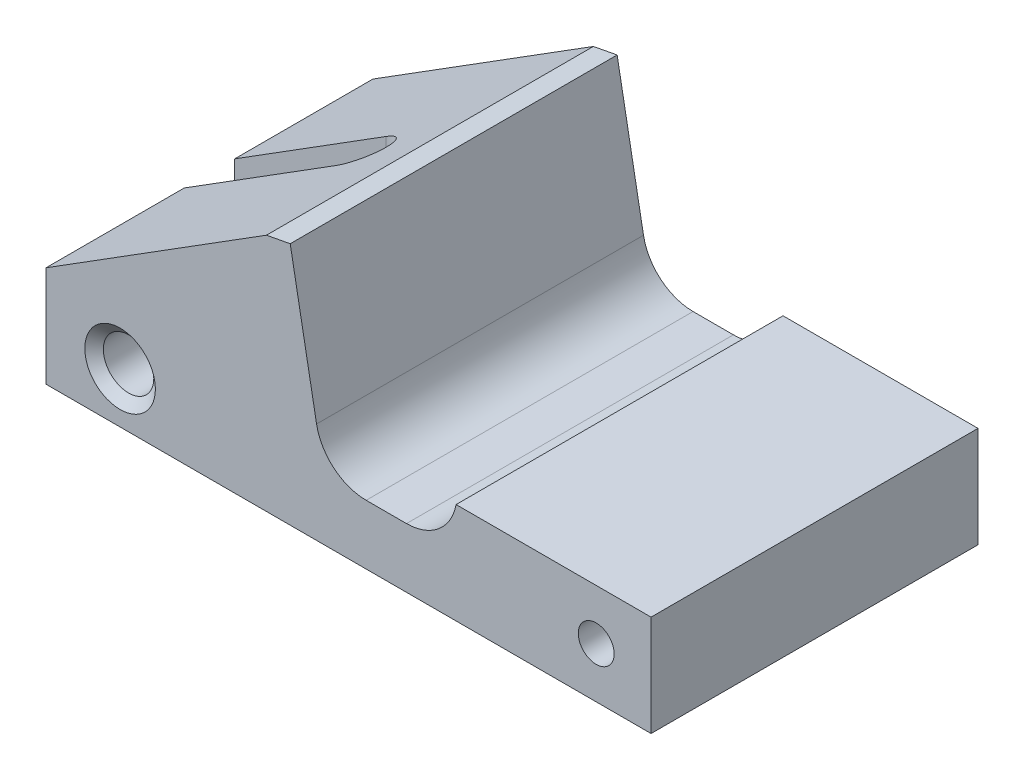
ISO-10303-21;
HEADER;
FILE_DESCRIPTION(('STEP AP214'),'2;1');
FILE_NAME('part.step','',(''),(''),'','','');
FILE_SCHEMA(('AUTOMOTIVE_DESIGN { 1 0 10303 214 1 1 1 1 }'));
ENDSEC;
DATA;
#1=APPLICATION_CONTEXT('core data for automotive mechanical design processes');
#2=APPLICATION_PROTOCOL_DEFINITION('international standard','automotive_design',2000,#1);
#3=PRODUCT_CONTEXT('',#1,'mechanical');
#4=PRODUCT('Part','Part','',(#3));
#5=PRODUCT_RELATED_PRODUCT_CATEGORY('part','',(#4));
#6=PRODUCT_DEFINITION_FORMATION('','',#4);
#7=PRODUCT_DEFINITION_CONTEXT('part definition',#1,'design');
#8=PRODUCT_DEFINITION('design','',#6,#7);
#9=PRODUCT_DEFINITION_SHAPE('','',#8);
#10=(LENGTH_UNIT() NAMED_UNIT(*) SI_UNIT(.MILLI.,.METRE.));
#11=(NAMED_UNIT(*) PLANE_ANGLE_UNIT() SI_UNIT($,.RADIAN.));
#12=(NAMED_UNIT(*) SI_UNIT($,.STERADIAN.) SOLID_ANGLE_UNIT());
#13=UNCERTAINTY_MEASURE_WITH_UNIT(LENGTH_MEASURE(1.E-05),#10,'distance_accuracy_value','');
#14=(GEOMETRIC_REPRESENTATION_CONTEXT(3) GLOBAL_UNCERTAINTY_ASSIGNED_CONTEXT((#13)) GLOBAL_UNIT_ASSIGNED_CONTEXT((#10,
#11,#12)) REPRESENTATION_CONTEXT('',''));
#15=CARTESIAN_POINT('',(0.,0.,0.));
#16=DIRECTION('',(0.,0.,1.));
#17=DIRECTION('',(1.,0.,0.));
#18=AXIS2_PLACEMENT_3D('',#15,#16,#17);
#19=CARTESIAN_POINT('',(0.,-74.8903123925255,64.202459724012));
#20=DIRECTION('',(0.,1.,0.));
#21=DIRECTION('',(0.,0.,1.));
#22=AXIS2_PLACEMENT_3D('',#19,#20,#21);
#23=PLANE('',#22);
#24=DIRECTION('',(1.,0.,0.));
#25=VECTOR('',#24,1.);
#26=CARTESIAN_POINT('',(-76.5670343709603,-74.8903123925255,13.15057164816));
#27=LINE('',#26,#25);
#28=CARTESIAN_POINT('',(-76.5670343709603,-74.8903123925255,13.15057164816));
#29=VERTEX_POINT('',#28);
#30=CARTESIAN_POINT('',(-67.0420343709603,-74.8903123925255,13.15057164816));
#31=VERTEX_POINT('',#30);
#32=EDGE_CURVE('E195',#29,#31,#27,.T.);
#33=ORIENTED_EDGE('',*,*,#32,.T.);
#34=CARTESIAN_POINT('',(-67.0420343709603,-74.8903123925255,11.56307164816));
#35=DIRECTION('',(0.,1.,0.));
#36=DIRECTION('',(0.,0.,1.));
#37=AXIS2_PLACEMENT_3D('',#34,#35,#36);
#38=CIRCLE('',#37,1.5875);
#39=CARTESIAN_POINT('',(-67.0420343709603,-74.8903123925255,9.97557164816));
#40=VERTEX_POINT('',#39);
#41=EDGE_CURVE('E192',#31,#40,#38,.T.);
#42=ORIENTED_EDGE('',*,*,#41,.T.);
#43=DIRECTION('',(-1.,0.,0.));
#44=VECTOR('',#43,1.);
#45=CARTESIAN_POINT('',(-76.5670343709603,-74.8903123925255,9.97557164816));
#46=LINE('',#45,#44);
#47=CARTESIAN_POINT('',(-76.5670343709603,-74.8903123925255,9.97557164816));
#48=VERTEX_POINT('',#47);
#49=EDGE_CURVE('E189',#40,#48,#46,.T.);
#50=ORIENTED_EDGE('',*,*,#49,.T.);
#51=DIRECTION('',(0.,0.,-1.));
#52=VECTOR('',#51,1.);
#53=CARTESIAN_POINT('',(-76.5670343709603,-74.8903123925255,64.202459724012));
#54=LINE('',#53,#52);
#55=CARTESIAN_POINT('',(-76.5670343709603,-74.8903123925255,1.27));
#56=VERTEX_POINT('',#55);
#57=EDGE_CURVE('E145',#48,#56,#54,.T.);
#58=ORIENTED_EDGE('',*,*,#57,.T.);
#59=DIRECTION('',(1.,0.,0.));
#60=VECTOR('',#59,1.);
#61=CARTESIAN_POINT('',(0.,-74.8903123925255,1.27));
#62=LINE('',#61,#60);
#63=CARTESIAN_POINT('',(-38.4670343709603,-74.8903123925255,1.27));
#64=VERTEX_POINT('',#63);
#65=EDGE_CURVE('E139',#56,#64,#62,.T.);
#66=ORIENTED_EDGE('',*,*,#65,.T.);
#67=DIRECTION('',(0.,0.,-1.));
#68=VECTOR('',#67,1.);
#69=CARTESIAN_POINT('',(-38.4670343709603,-74.8903123925255,64.202459724012));
#70=LINE('',#69,#68);
#71=CARTESIAN_POINT('',(-38.4670343709603,-74.8903123925255,21.85614329632));
#72=VERTEX_POINT('',#71);
#73=EDGE_CURVE('E142',#72,#64,#70,.T.);
#74=ORIENTED_EDGE('',*,*,#73,.F.);
#75=DIRECTION('',(-1.,0.,0.));
#76=VECTOR('',#75,1.);
#77=CARTESIAN_POINT('',(0.,-74.8903123925255,21.8561432963201));
#78=LINE('',#77,#76);
#79=CARTESIAN_POINT('',(-76.5670343709603,-74.8903123925255,21.85614329632));
#80=VERTEX_POINT('',#79);
#81=EDGE_CURVE('E82',#72,#80,#78,.T.);
#82=ORIENTED_EDGE('',*,*,#81,.T.);
#83=EDGE_CURVE('E146',#80,#29,#54,.T.);
#84=ORIENTED_EDGE('',*,*,#83,.T.);
#85=EDGE_LOOP('',(#33,#42,#50,#58,#66,#74,#82,#84));
#86=FACE_BOUND('',#85,.T.);
#87=ADVANCED_FACE('F39',(#86),#23,.F.);
#88=CARTESIAN_POINT('',(-76.5670343709603,0.,64.202459724012));
#89=DIRECTION('',(1.,0.,0.));
#90=DIRECTION('',(0.,0.,-1.));
#91=AXIS2_PLACEMENT_3D('',#88,#89,#90);
#92=PLANE('',#91);
#93=DIRECTION('',(0.,-1.,0.));
#94=VECTOR('',#93,1.);
#95=CARTESIAN_POINT('',(-76.5670343709603,-59.5392938182459,13.15057164816));
#96=LINE('',#95,#94);
#97=CARTESIAN_POINT('',(-76.5670343709604,-68.5403123925256,13.15057164816));
#98=VERTEX_POINT('',#97);
#99=EDGE_CURVE('E127',#98,#29,#96,.T.);
#100=ORIENTED_EDGE('',*,*,#99,.T.);
#101=ORIENTED_EDGE('',*,*,#83,.F.);
#102=DIRECTION('',(0.,1.,0.));
#103=VECTOR('',#102,1.);
#104=CARTESIAN_POINT('',(-76.5670343709603,0.,21.85614329632));
#105=LINE('',#104,#103);
#106=CARTESIAN_POINT('',(-76.5670343709603,-68.5403123925255,21.85614329632));
#107=VERTEX_POINT('',#106);
#108=EDGE_CURVE('E116',#80,#107,#105,.T.);
#109=ORIENTED_EDGE('',*,*,#108,.T.);
#110=DIRECTION('',(0.,0.,-1.));
#111=VECTOR('',#110,1.);
#112=CARTESIAN_POINT('',(-76.5670343709603,-68.5403123925255,64.202459724012));
#113=LINE('',#112,#111);
#114=EDGE_CURVE('E150',#107,#98,#113,.T.);
#115=ORIENTED_EDGE('',*,*,#114,.T.);
#116=EDGE_LOOP('',(#100,#101,#109,#115));
#117=FACE_BOUND('',#116,.T.);
#118=ADVANCED_FACE('F178',(#117),#92,.F.);
#119=DIRECTION('',(0.,-1.,0.));
#120=VECTOR('',#119,1.);
#121=CARTESIAN_POINT('',(-76.5670343709603,-59.5392938182459,9.97557164816));
#122=LINE('',#121,#120);
#123=CARTESIAN_POINT('',(-76.5670343709604,-68.5403123925256,9.97557164816));
#124=VERTEX_POINT('',#123);
#125=EDGE_CURVE('E186',#124,#48,#122,.T.);
#126=ORIENTED_EDGE('',*,*,#125,.F.);
#127=CARTESIAN_POINT('',(-76.5670343709603,-68.5403123925255,1.27));
#128=VERTEX_POINT('',#127);
#129=EDGE_CURVE('E149',#124,#128,#113,.T.);
#130=ORIENTED_EDGE('',*,*,#129,.T.);
#131=DIRECTION('',(0.,-1.,0.));
#132=VECTOR('',#131,1.);
#133=CARTESIAN_POINT('',(-76.5670343709603,0.,1.27));
#134=LINE('',#133,#132);
#135=EDGE_CURVE('E136',#128,#56,#134,.T.);
#136=ORIENTED_EDGE('',*,*,#135,.T.);
#137=ORIENTED_EDGE('',*,*,#57,.F.);
#138=EDGE_LOOP('',(#126,#130,#136,#137));
#139=FACE_BOUND('',#138,.T.);
#140=ADVANCED_FACE('F303',(#139),#92,.F.);
#141=CARTESIAN_POINT('',(9.21337286479048,-14.6712600702126,64.202459724012));
#142=DIRECTION('',(-0.531817244546005,0.846859149093575,0.));
#143=DIRECTION('',(-0.846859149093575,-0.531817244546005,0.));
#144=AXIS2_PLACEMENT_3D('',#141,#142,#143);
#145=PLANE('',#144);
#146=CARTESIAN_POINT('',(-67.0420343709603,-62.5587282533891,11.56307164816));
#147=DIRECTION('',(-0.531817244546005,0.846859149093575,0.));
#148=DIRECTION('',(-0.846859149093575,-0.531817244546005,0.));
#149=AXIS2_PLACEMENT_3D('',#146,#147,#148);
#150=ELLIPSE('',#149,1.87457383166866,1.5875);
#151=CARTESIAN_POINT('',(-67.0420343709603,-62.5587282533891,9.97557164816));
#152=VERTEX_POINT('',#151);
#153=CARTESIAN_POINT('',(-67.0420343709603,-62.5587282533891,13.15057164816));
#154=VERTEX_POINT('',#153);
#155=EDGE_CURVE('E161',#152,#154,#150,.F.);
#156=ORIENTED_EDGE('',*,*,#155,.T.);
#157=DIRECTION('',(-0.846859149093576,-0.531817244546005,0.));
#158=VECTOR('',#157,1.);
#159=CARTESIAN_POINT('',(9.21337286479048,-14.6712600702126,13.15057164816));
#160=LINE('',#159,#158);
#161=EDGE_CURVE('E47',#154,#98,#160,.T.);
#162=ORIENTED_EDGE('',*,*,#161,.T.);
#163=ORIENTED_EDGE('',*,*,#114,.F.);
#164=DIRECTION('',(-0.846859149093575,-0.531817244546005,0.));
#165=VECTOR('',#164,1.);
#166=CARTESIAN_POINT('',(9.21337286479055,-14.6712600702126,21.8561432963202));
#167=LINE('',#166,#165);
#168=CARTESIAN_POINT('',(-62.6864919469721,-59.8235005913772,21.85614329632));
#169=VERTEX_POINT('',#168);
#170=EDGE_CURVE('E63',#169,#107,#167,.T.);
#171=ORIENTED_EDGE('',*,*,#170,.F.);
#172=DIRECTION('',(0.,0.,-1.));
#173=VECTOR('',#172,1.);
#174=CARTESIAN_POINT('',(-62.6864919469721,-59.8235005913772,64.202459724012));
#175=LINE('',#174,#173);
#176=CARTESIAN_POINT('',(-62.6864919469721,-59.8235005913772,1.27));
#177=VERTEX_POINT('',#176);
#178=EDGE_CURVE('E111',#169,#177,#175,.T.);
#179=ORIENTED_EDGE('',*,*,#178,.T.);
#180=DIRECTION('',(0.846859149093575,0.531817244546005,0.));
#181=VECTOR('',#180,1.);
#182=CARTESIAN_POINT('',(9.21337286479048,-14.6712600702126,1.27));
#183=LINE('',#182,#181);
#184=EDGE_CURVE('E133',#128,#177,#183,.T.);
#185=ORIENTED_EDGE('',*,*,#184,.F.);
#186=ORIENTED_EDGE('',*,*,#129,.F.);
#187=DIRECTION('',(0.846859149093576,0.531817244546005,0.));
#188=VECTOR('',#187,1.);
#189=CARTESIAN_POINT('',(9.21337286479048,-14.6712600702126,9.97557164816));
#190=LINE('',#189,#188);
#191=EDGE_CURVE('E122',#124,#152,#190,.T.);
#192=ORIENTED_EDGE('',*,*,#191,.T.);
#193=EDGE_LOOP('',(#156,#162,#163,#171,#179,#185,#186,#192));
#194=FACE_BOUND('',#193,.T.);
#195=ADVANCED_FACE('F167',(#194),#145,.T.);
#196=CARTESIAN_POINT('',(0.,0.,1.27));
#197=DIRECTION('',(0.,0.,1.));
#198=DIRECTION('',(1.,0.,0.));
#199=AXIS2_PLACEMENT_3D('',#196,#197,#198);
#200=PLANE('',#199);
#201=CARTESIAN_POINT('',(-41.9214343709603,-71.7153123925255,1.27));
#202=DIRECTION('',(0.,0.,1.));
#203=DIRECTION('',(1.,0.,0.));
#204=AXIS2_PLACEMENT_3D('',#201,#202,#203);
#205=CIRCLE('',#204,1.13029999999999);
#206=CARTESIAN_POINT('',(-40.7911343709603,-71.7153123925255,1.27));
#207=VERTEX_POINT('',#206);
#208=EDGE_CURVE('E213',#207,#207,#205,.T.);
#209=ORIENTED_EDGE('',*,*,#208,.T.);
#210=EDGE_LOOP('',(#209));
#211=FACE_BOUND('',#210,.T.);
#212=CARTESIAN_POINT('',(-71.9013597764265,-71.7153123925255,1.27));
#213=DIRECTION('',(0.,0.,1.));
#214=DIRECTION('',(1.,0.,0.));
#215=AXIS2_PLACEMENT_3D('',#212,#213,#214);
#216=CIRCLE('',#215,1.58749999999999);
#217=CARTESIAN_POINT('',(-70.3138597764265,-71.7153123925255,1.27));
#218=VERTEX_POINT('',#217);
#219=EDGE_CURVE('E204',#218,#218,#216,.T.);
#220=ORIENTED_EDGE('',*,*,#219,.T.);
#221=EDGE_LOOP('',(#220));
#222=FACE_BOUND('',#221,.T.);
#223=DIRECTION('',(1.,0.,0.));
#224=VECTOR('',#223,1.);
#225=CARTESIAN_POINT('',(-53.8676659630811,-71.1397587966467,1.27));
#226=LINE('',#225,#224);
#227=CARTESIAN_POINT('',(-56.4076659630811,-71.1397587966467,1.27));
#228=VERTEX_POINT('',#227);
#229=CARTESIAN_POINT('',(-53.8676659630811,-71.1397587966467,1.27));
#230=VERTEX_POINT('',#229);
#231=EDGE_CURVE('E226',#228,#230,#226,.T.);
#232=ORIENTED_EDGE('',*,*,#231,.T.);
#233=CARTESIAN_POINT('',(-53.8676659630811,-67.9647587966467,1.27));
#234=DIRECTION('',(0.,0.,1.));
#235=DIRECTION('',(1.,0.,0.));
#236=AXIS2_PLACEMENT_3D('',#233,#234,#235);
#237=CIRCLE('',#236,3.175);
#238=CARTESIAN_POINT('',(-50.7452689578509,-68.5403123925255,1.27));
#239=VERTEX_POINT('',#238);
#240=EDGE_CURVE('E232',#230,#239,#237,.T.);
#241=ORIENTED_EDGE('',*,*,#240,.T.);
#242=DIRECTION('',(1.,0.,0.));
#243=VECTOR('',#242,1.);
#244=CARTESIAN_POINT('',(0.,-68.5403123925255,1.27));
#245=LINE('',#244,#243);
#246=CARTESIAN_POINT('',(-38.4670343709603,-68.5403123925255,1.27));
#247=VERTEX_POINT('',#246);
#248=EDGE_CURVE('E126',#239,#247,#245,.T.);
#249=ORIENTED_EDGE('',*,*,#248,.T.);
#250=DIRECTION('',(0.,-1.,0.));
#251=VECTOR('',#250,1.);
#252=CARTESIAN_POINT('',(-38.4670343709605,0.,1.27));
#253=LINE('',#252,#251);
#254=EDGE_CURVE('E123',#247,#64,#253,.T.);
#255=ORIENTED_EDGE('',*,*,#254,.T.);
#256=ORIENTED_EDGE('',*,*,#65,.F.);
#257=ORIENTED_EDGE('',*,*,#135,.F.);
#258=ORIENTED_EDGE('',*,*,#184,.T.);
#259=DIRECTION('',(0.982457355629022,0.186487383944411,0.));
#260=VECTOR('',#259,1.);
#261=CARTESIAN_POINT('',(8.7805343718107,-46.2578239743569,1.27));
#262=LINE('',#261,#260);
#263=CARTESIAN_POINT('',(-61.1892269369935,-59.5392938182459,1.27));
#264=VERTEX_POINT('',#263);
#265=EDGE_CURVE('E131',#177,#264,#262,.T.);
#266=ORIENTED_EDGE('',*,*,#265,.T.);
#267=DIRECTION('',(0.181276723111443,-0.983432127631581,0.));
#268=VECTOR('',#267,1.);
#269=CARTESIAN_POINT('',(-69.7927420063568,-12.8649443234525,1.27));
#270=LINE('',#269,#268);
#271=CARTESIAN_POINT('',(-59.5300629683114,-68.5403123925255,1.27));
#272=VERTEX_POINT('',#271);
#273=EDGE_CURVE('E106',#264,#272,#270,.T.);
#274=ORIENTED_EDGE('',*,*,#273,.T.);
#275=CARTESIAN_POINT('',(-56.4076659630811,-67.9647587966467,1.27));
#276=DIRECTION('',(0.,0.,1.));
#277=DIRECTION('',(1.,0.,0.));
#278=AXIS2_PLACEMENT_3D('',#275,#276,#277);
#279=CIRCLE('',#278,3.175);
#280=EDGE_CURVE('E238',#272,#228,#279,.T.);
#281=ORIENTED_EDGE('',*,*,#280,.T.);
#282=EDGE_LOOP('',(#232,#241,#249,#255,#256,#257,#258,#266,#274,#281));
#283=FACE_BOUND('',#282,.T.);
#284=ADVANCED_FACE('F246',(#211,#222,#283),#200,.F.);
#285=CARTESIAN_POINT('',(8.7805343718107,-46.2578239743569,64.202459724012));
#286=DIRECTION('',(-0.186487383944411,0.982457355629022,0.));
#287=DIRECTION('',(-0.982457355629022,-0.186487383944411,0.));
#288=AXIS2_PLACEMENT_3D('',#285,#286,#287);
#289=PLANE('',#288);
#290=DIRECTION('',(-0.982457355629022,-0.186487383944411,0.));
#291=VECTOR('',#290,1.);
#292=CARTESIAN_POINT('',(8.78053437181079,-46.2578239743569,21.8561432963202));
#293=LINE('',#292,#291);
#294=CARTESIAN_POINT('',(-61.1892269369935,-59.5392938182459,21.85614329632));
#295=VERTEX_POINT('',#294);
#296=EDGE_CURVE('E92',#295,#169,#293,.T.);
#297=ORIENTED_EDGE('',*,*,#296,.F.);
#298=DIRECTION('',(0.,0.,-1.));
#299=VECTOR('',#298,1.);
#300=CARTESIAN_POINT('',(-61.1892269369935,-59.5392938182459,64.202459724012));
#301=LINE('',#300,#299);
#302=EDGE_CURVE('E102',#295,#264,#301,.T.);
#303=ORIENTED_EDGE('',*,*,#302,.T.);
#304=ORIENTED_EDGE('',*,*,#265,.F.);
#305=ORIENTED_EDGE('',*,*,#178,.F.);
#306=EDGE_LOOP('',(#297,#303,#304,#305));
#307=FACE_BOUND('',#306,.T.);
#308=ADVANCED_FACE('F113',(#307),#289,.T.);
#309=CARTESIAN_POINT('',(-69.7927420063568,-12.8649443234525,64.202459724012));
#310=DIRECTION('',(0.98343212763158,0.181276723111443,0.));
#311=DIRECTION('',(-0.181276723111443,0.983432127631581,0.));
#312=AXIS2_PLACEMENT_3D('',#309,#310,#311);
#313=PLANE('',#312);
#314=DIRECTION('',(-0.181276723111443,0.983432127631581,0.));
#315=VECTOR('',#314,1.);
#316=CARTESIAN_POINT('',(-69.7927420063568,-12.8649443234525,21.85614329632));
#317=LINE('',#316,#315);
#318=CARTESIAN_POINT('',(-59.5300629683114,-68.5403123925255,21.85614329632));
#319=VERTEX_POINT('',#318);
#320=EDGE_CURVE('E88',#319,#295,#317,.T.);
#321=ORIENTED_EDGE('',*,*,#320,.F.);
#322=DIRECTION('',(0.,0.,-1.));
#323=VECTOR('',#322,1.);
#324=CARTESIAN_POINT('',(-59.5300629683114,-68.5403123925255,64.202459724012));
#325=LINE('',#324,#323);
#326=EDGE_CURVE('E110',#319,#272,#325,.T.);
#327=ORIENTED_EDGE('',*,*,#326,.T.);
#328=ORIENTED_EDGE('',*,*,#273,.F.);
#329=ORIENTED_EDGE('',*,*,#302,.F.);
#330=EDGE_LOOP('',(#321,#327,#328,#329));
#331=FACE_BOUND('',#330,.T.);
#332=ADVANCED_FACE('F103',(#331),#313,.T.);
#333=CARTESIAN_POINT('',(0.,-68.5403123925255,64.202459724012));
#334=DIRECTION('',(0.,1.,0.));
#335=DIRECTION('',(0.,0.,1.));
#336=AXIS2_PLACEMENT_3D('',#333,#334,#335);
#337=PLANE('',#336);
#338=DIRECTION('',(0.,0.,1.));
#339=VECTOR('',#338,1.);
#340=CARTESIAN_POINT('',(-50.7452689578509,-68.5403123925255,1.27));
#341=LINE('',#340,#339);
#342=CARTESIAN_POINT('',(-50.7452689578509,-68.5403123925255,21.8561432963201));
#343=VERTEX_POINT('',#342);
#344=EDGE_CURVE('E219',#343,#239,#341,.F.);
#345=ORIENTED_EDGE('',*,*,#344,.F.);
#346=DIRECTION('',(-1.,0.,0.));
#347=VECTOR('',#346,1.);
#348=CARTESIAN_POINT('',(0.,-68.5403123925255,21.8561432963201));
#349=LINE('',#348,#347);
#350=CARTESIAN_POINT('',(-38.4670343709603,-68.5403123925255,21.85614329632));
#351=VERTEX_POINT('',#350);
#352=EDGE_CURVE('E98',#351,#343,#349,.T.);
#353=ORIENTED_EDGE('',*,*,#352,.F.);
#354=DIRECTION('',(0.,0.,-1.));
#355=VECTOR('',#354,1.);
#356=CARTESIAN_POINT('',(-38.4670343709603,-68.5403123925255,64.202459724012));
#357=LINE('',#356,#355);
#358=EDGE_CURVE('E155',#351,#247,#357,.T.);
#359=ORIENTED_EDGE('',*,*,#358,.T.);
#360=ORIENTED_EDGE('',*,*,#248,.F.);
#361=EDGE_LOOP('',(#345,#353,#359,#360));
#362=FACE_BOUND('',#361,.T.);
#363=ADVANCED_FACE('F254',(#362),#337,.T.);
#364=CARTESIAN_POINT('',(-38.4670343709605,0.,64.202459724012));
#365=DIRECTION('',(1.,0.,0.));
#366=DIRECTION('',(0.,1.,0.));
#367=AXIS2_PLACEMENT_3D('',#364,#365,#366);
#368=PLANE('',#367);
#369=DIRECTION('',(0.,1.,0.));
#370=VECTOR('',#369,1.);
#371=CARTESIAN_POINT('',(-38.4670343709605,0.,21.8561432963201));
#372=LINE('',#371,#370);
#373=EDGE_CURVE('E75',#72,#351,#372,.T.);
#374=ORIENTED_EDGE('',*,*,#373,.F.);
#375=ORIENTED_EDGE('',*,*,#73,.T.);
#376=ORIENTED_EDGE('',*,*,#254,.F.);
#377=ORIENTED_EDGE('',*,*,#358,.F.);
#378=EDGE_LOOP('',(#374,#375,#376,#377));
#379=FACE_BOUND('',#378,.T.);
#380=ADVANCED_FACE('F41',(#379),#368,.T.);
#381=CARTESIAN_POINT('',(-34.8598381796,-193.67470749233,21.85614329632));
#382=DIRECTION('',(0.,0.,-1.));
#383=DIRECTION('',(-0.999995874513973,-0.00287244756860379,0.));
#384=AXIS2_PLACEMENT_3D('',#381,#382,#383);
#385=PLANE('',#384);
#386=CARTESIAN_POINT('',(-41.9214343709603,-71.7153123925255,21.8561432963201));
#387=DIRECTION('',(0.,0.,1.));
#388=DIRECTION('',(1.,0.,0.));
#389=AXIS2_PLACEMENT_3D('',#386,#387,#388);
#390=CIRCLE('',#389,1.13029999999999);
#391=CARTESIAN_POINT('',(-40.7911343709603,-71.7153123925255,21.8561432963201));
#392=VERTEX_POINT('',#391);
#393=EDGE_CURVE('E216',#392,#392,#390,.T.);
#394=ORIENTED_EDGE('',*,*,#393,.F.);
#395=EDGE_LOOP('',(#394));
#396=FACE_BOUND('',#395,.T.);
#397=CARTESIAN_POINT('',(-71.9013597764265,-71.7153123925255,21.8561432963201));
#398=DIRECTION('',(0.,0.,1.));
#399=DIRECTION('',(1.,0.,0.));
#400=AXIS2_PLACEMENT_3D('',#397,#398,#399);
#401=CIRCLE('',#400,2.2225);
#402=CARTESIAN_POINT('',(-69.6788597764265,-71.7153123925255,21.8561432963201));
#403=VERTEX_POINT('',#402);
#404=EDGE_CURVE('E210',#403,#403,#401,.T.);
#405=ORIENTED_EDGE('',*,*,#404,.F.);
#406=EDGE_LOOP('',(#405));
#407=FACE_BOUND('',#406,.T.);
#408=ORIENTED_EDGE('',*,*,#352,.T.);
#409=CARTESIAN_POINT('',(-53.8676659630811,-67.9647587966467,21.8561432963201));
#410=DIRECTION('',(0.,0.,1.));
#411=DIRECTION('',(1.,0.,0.));
#412=AXIS2_PLACEMENT_3D('',#409,#410,#411);
#413=CIRCLE('',#412,3.175);
#414=CARTESIAN_POINT('',(-53.8676659630811,-71.1397587966467,21.8561432963201));
#415=VERTEX_POINT('',#414);
#416=EDGE_CURVE('E233',#415,#343,#413,.T.);
#417=ORIENTED_EDGE('',*,*,#416,.F.);
#418=DIRECTION('',(1.,0.,0.));
#419=VECTOR('',#418,1.);
#420=CARTESIAN_POINT('',(-53.8676659630811,-71.1397587966467,21.8561432963201));
#421=LINE('',#420,#419);
#422=CARTESIAN_POINT('',(-56.4076659630811,-71.1397587966467,21.8561432963201));
#423=VERTEX_POINT('',#422);
#424=EDGE_CURVE('E229',#423,#415,#421,.T.);
#425=ORIENTED_EDGE('',*,*,#424,.F.);
#426=CARTESIAN_POINT('',(-56.4076659630811,-67.9647587966467,21.85614329632));
#427=DIRECTION('',(0.,0.,-1.));
#428=DIRECTION('',(-1.,0.,0.));
#429=AXIS2_PLACEMENT_3D('',#426,#427,#428);
#430=CIRCLE('',#429,3.175);
#431=EDGE_CURVE('E12',#423,#319,#430,.T.);
#432=ORIENTED_EDGE('',*,*,#431,.T.);
#433=ORIENTED_EDGE('',*,*,#320,.T.);
#434=ORIENTED_EDGE('',*,*,#296,.T.);
#435=ORIENTED_EDGE('',*,*,#170,.T.);
#436=ORIENTED_EDGE('',*,*,#108,.F.);
#437=ORIENTED_EDGE('',*,*,#81,.F.);
#438=ORIENTED_EDGE('',*,*,#373,.T.);
#439=EDGE_LOOP('',(#408,#417,#425,#432,#433,#434,#435,#436,#437,#438));
#440=FACE_BOUND('',#439,.T.);
#441=ADVANCED_FACE('F90',(#396,#407,#440),#385,.F.);
#442=CARTESIAN_POINT('',(-76.5670343709603,-59.5392938182459,13.15057164816));
#443=DIRECTION('',(0.,0.,-1.));
#444=DIRECTION('',(-1.,0.,0.));
#445=AXIS2_PLACEMENT_3D('',#442,#443,#444);
#446=PLANE('',#445);
#447=CARTESIAN_POINT('',(-71.9013597764265,-71.7153123925255,13.15057164816));
#448=DIRECTION('',(0.,0.,-1.));
#449=DIRECTION('',(-1.,0.,0.));
#450=AXIS2_PLACEMENT_3D('',#447,#448,#449);
#451=CIRCLE('',#450,1.5875);
#452=CARTESIAN_POINT('',(-73.4888597764265,-71.7153123925255,13.15057164816));
#453=VERTEX_POINT('',#452);
#454=EDGE_CURVE('E201',#453,#453,#451,.T.);
#455=ORIENTED_EDGE('',*,*,#454,.F.);
#456=EDGE_LOOP('',(#455));
#457=FACE_BOUND('',#456,.T.);
#458=DIRECTION('',(0.,-1.,0.));
#459=VECTOR('',#458,1.);
#460=CARTESIAN_POINT('',(-67.0420343709603,-59.5392938182459,13.15057164816));
#461=LINE('',#460,#459);
#462=EDGE_CURVE('E183',#154,#31,#461,.T.);
#463=ORIENTED_EDGE('',*,*,#462,.T.);
#464=ORIENTED_EDGE('',*,*,#32,.F.);
#465=ORIENTED_EDGE('',*,*,#99,.F.);
#466=ORIENTED_EDGE('',*,*,#161,.F.);
#467=EDGE_LOOP('',(#463,#464,#465,#466));
#468=FACE_BOUND('',#467,.T.);
#469=ADVANCED_FACE('F310',(#457,#468),#446,.T.);
#470=CARTESIAN_POINT('',(-67.0420343709603,-59.5392938182459,11.56307164816));
#471=DIRECTION('',(0.,-1.,0.));
#472=DIRECTION('',(0.,0.,-1.));
#473=AXIS2_PLACEMENT_3D('',#470,#471,#472);
#474=CYLINDRICAL_SURFACE('',#473,1.5875);
#475=DIRECTION('',(0.,-1.,0.));
#476=VECTOR('',#475,1.);
#477=CARTESIAN_POINT('',(-67.0420343709603,-59.5392938182459,9.97557164816));
#478=LINE('',#477,#476);
#479=EDGE_CURVE('E54',#152,#40,#478,.T.);
#480=ORIENTED_EDGE('',*,*,#479,.T.);
#481=ORIENTED_EDGE('',*,*,#41,.F.);
#482=ORIENTED_EDGE('',*,*,#462,.F.);
#483=ORIENTED_EDGE('',*,*,#155,.F.);
#484=EDGE_LOOP('',(#480,#481,#482,#483));
#485=FACE_BOUND('',#484,.T.);
#486=ADVANCED_FACE('F309',(#485),#474,.F.);
#487=CARTESIAN_POINT('',(-76.5670343709603,-59.5392938182459,9.97557164816));
#488=DIRECTION('',(0.,0.,1.));
#489=DIRECTION('',(1.,0.,0.));
#490=AXIS2_PLACEMENT_3D('',#487,#488,#489);
#491=PLANE('',#490);
#492=CARTESIAN_POINT('',(-71.9013597764265,-71.7153123925255,9.97557164816));
#493=DIRECTION('',(0.,0.,1.));
#494=DIRECTION('',(1.,0.,0.));
#495=AXIS2_PLACEMENT_3D('',#492,#493,#494);
#496=CIRCLE('',#495,1.5875);
#497=CARTESIAN_POINT('',(-70.3138597764265,-71.7153123925255,9.97557164816));
#498=VERTEX_POINT('',#497);
#499=EDGE_CURVE('E198',#498,#498,#496,.T.);
#500=ORIENTED_EDGE('',*,*,#499,.F.);
#501=EDGE_LOOP('',(#500));
#502=FACE_BOUND('',#501,.T.);
#503=ORIENTED_EDGE('',*,*,#125,.T.);
#504=ORIENTED_EDGE('',*,*,#49,.F.);
#505=ORIENTED_EDGE('',*,*,#479,.F.);
#506=ORIENTED_EDGE('',*,*,#191,.F.);
#507=EDGE_LOOP('',(#503,#504,#505,#506));
#508=FACE_BOUND('',#507,.T.);
#509=ADVANCED_FACE('F305',(#502,#508),#491,.T.);
#510=CARTESIAN_POINT('',(-71.9013597764265,-71.7153123925255,21.8561432963201));
#511=DIRECTION('',(0.,0.,1.));
#512=DIRECTION('',(1.,0.,0.));
#513=AXIS2_PLACEMENT_3D('',#510,#511,#512);
#514=CYLINDRICAL_SURFACE('',#513,1.5875);
#515=ORIENTED_EDGE('',*,*,#499,.T.);
#516=EDGE_LOOP('',(#515));
#517=FACE_BOUND('',#516,.T.);
#518=ORIENTED_EDGE('',*,*,#219,.F.);
#519=EDGE_LOOP('',(#518));
#520=FACE_BOUND('',#519,.T.);
#521=ADVANCED_FACE('F392',(#517,#520),#514,.F.);
#522=ORIENTED_EDGE('',*,*,#454,.T.);
#523=EDGE_LOOP('',(#522));
#524=FACE_BOUND('',#523,.T.);
#525=CARTESIAN_POINT('',(-71.9013597764265,-71.7153123925255,21.3233150305226));
#526=DIRECTION('',(0.,0.,1.));
#527=DIRECTION('',(1.,0.,0.));
#528=AXIS2_PLACEMENT_3D('',#525,#526,#527);
#529=CIRCLE('',#528,1.58750000000001);
#530=CARTESIAN_POINT('',(-70.3138597764265,-71.7153123925255,21.3233150305226));
#531=VERTEX_POINT('',#530);
#532=EDGE_CURVE('E207',#531,#531,#529,.T.);
#533=ORIENTED_EDGE('',*,*,#532,.T.);
#534=EDGE_LOOP('',(#533));
#535=FACE_BOUND('',#534,.T.);
#536=ADVANCED_FACE('F388',(#524,#535),#514,.F.);
#537=CARTESIAN_POINT('',(-71.9013597764265,-71.7153123925255,21.8561432963201));
#538=DIRECTION('',(0.,0.,1.));
#539=DIRECTION('',(1.,0.,0.));
#540=AXIS2_PLACEMENT_3D('',#537,#538,#539);
#541=CONICAL_SURFACE('',#540,2.2225,0.872664625997158);
#542=ORIENTED_EDGE('',*,*,#532,.F.);
#543=EDGE_LOOP('',(#542));
#544=FACE_BOUND('',#543,.T.);
#545=ORIENTED_EDGE('',*,*,#404,.T.);
#546=EDGE_LOOP('',(#545));
#547=FACE_BOUND('',#546,.T.);
#548=ADVANCED_FACE('F384',(#544,#547),#541,.F.);
#549=CARTESIAN_POINT('',(-41.9214343709603,-71.7153123925255,21.8561432963201));
#550=DIRECTION('',(0.,0.,1.));
#551=DIRECTION('',(1.,0.,0.));
#552=AXIS2_PLACEMENT_3D('',#549,#550,#551);
#553=CYLINDRICAL_SURFACE('',#552,1.13029999999999);
#554=ORIENTED_EDGE('',*,*,#208,.F.);
#555=EDGE_LOOP('',(#554));
#556=FACE_BOUND('',#555,.T.);
#557=ORIENTED_EDGE('',*,*,#393,.T.);
#558=EDGE_LOOP('',(#557));
#559=FACE_BOUND('',#558,.T.);
#560=ADVANCED_FACE('F360',(#556,#559),#553,.F.);
#561=CARTESIAN_POINT('',(-53.8676659630811,-67.9647587966467,1.27));
#562=DIRECTION('',(0.,0.,1.));
#563=DIRECTION('',(1.,0.,0.));
#564=AXIS2_PLACEMENT_3D('',#561,#562,#563);
#565=CYLINDRICAL_SURFACE('',#564,3.175);
#566=ORIENTED_EDGE('',*,*,#344,.T.);
#567=ORIENTED_EDGE('',*,*,#240,.F.);
#568=DIRECTION('',(0.,0.,1.));
#569=VECTOR('',#568,1.);
#570=CARTESIAN_POINT('',(-53.8676659630811,-71.1397587966467,1.27));
#571=LINE('',#570,#569);
#572=EDGE_CURVE('E222',#230,#415,#571,.T.);
#573=ORIENTED_EDGE('',*,*,#572,.T.);
#574=ORIENTED_EDGE('',*,*,#416,.T.);
#575=EDGE_LOOP('',(#566,#567,#573,#574));
#576=FACE_BOUND('',#575,.T.);
#577=ADVANCED_FACE('F355',(#576),#565,.F.);
#578=CARTESIAN_POINT('',(-53.8676659630811,-71.1397587966467,1.27));
#579=DIRECTION('',(0.,-1.,0.));
#580=DIRECTION('',(0.,0.,-1.));
#581=AXIS2_PLACEMENT_3D('',#578,#579,#580);
#582=PLANE('',#581);
#583=ORIENTED_EDGE('',*,*,#424,.T.);
#584=ORIENTED_EDGE('',*,*,#572,.F.);
#585=ORIENTED_EDGE('',*,*,#231,.F.);
#586=DIRECTION('',(0.,0.,1.));
#587=VECTOR('',#586,1.);
#588=CARTESIAN_POINT('',(-56.4076659630811,-71.1397587966467,1.27));
#589=LINE('',#588,#587);
#590=EDGE_CURVE('E223',#228,#423,#589,.T.);
#591=ORIENTED_EDGE('',*,*,#590,.T.);
#592=EDGE_LOOP('',(#583,#584,#585,#591));
#593=FACE_BOUND('',#592,.T.);
#594=ADVANCED_FACE('F298',(#593),#582,.F.);
#595=CARTESIAN_POINT('',(-56.4076659630811,-67.9647587966467,1.27));
#596=DIRECTION('',(0.,0.,1.));
#597=DIRECTION('',(1.,0.,0.));
#598=AXIS2_PLACEMENT_3D('',#595,#596,#597);
#599=CYLINDRICAL_SURFACE('',#598,3.175);
#600=ORIENTED_EDGE('',*,*,#326,.F.);
#601=ORIENTED_EDGE('',*,*,#431,.F.);
#602=ORIENTED_EDGE('',*,*,#590,.F.);
#603=ORIENTED_EDGE('',*,*,#280,.F.);
#604=EDGE_LOOP('',(#600,#601,#602,#603));
#605=FACE_BOUND('',#604,.T.);
#606=ADVANCED_FACE('F296',(#605),#599,.F.);
#607=CLOSED_SHELL('',(#87,#118,#140,#195,#284,#308,#332,#363,#380,#441,#469,#486,#509,#521,#536,
#548,#560,#577,#594,#606));
#608=MANIFOLD_SOLID_BREP('B2',#607);
#609=ADVANCED_BREP_SHAPE_REPRESENTATION('',(#18,#608),#14);
#610=SHAPE_DEFINITION_REPRESENTATION(#9,#609);
ENDSEC;
END-ISO-10303-21;
